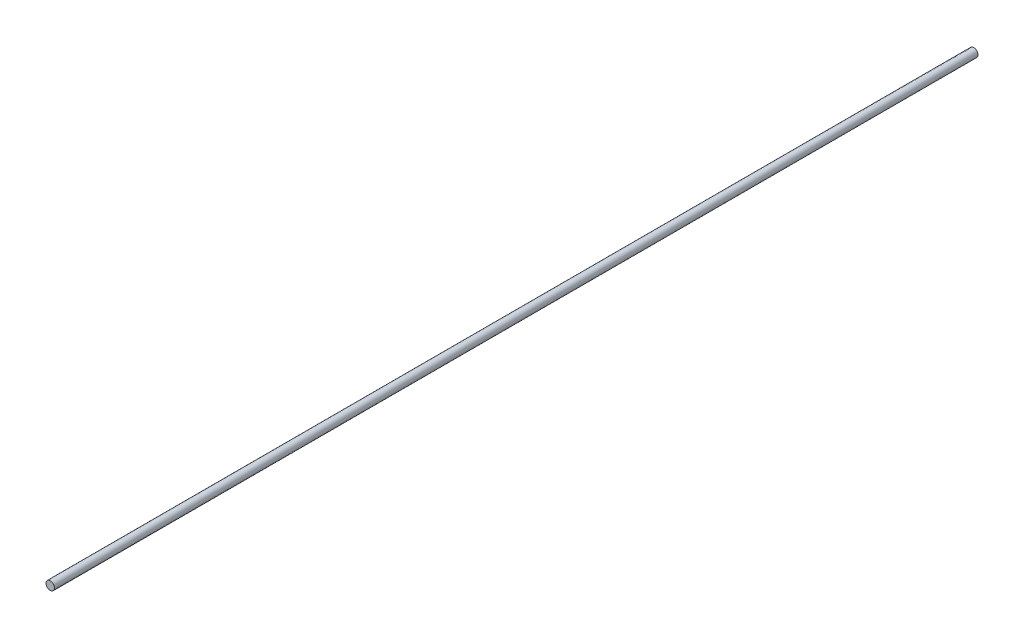
ISO-10303-21;
HEADER;
FILE_DESCRIPTION(('STEP AP214'),'2;1');
FILE_NAME('part.step','',(''),(''),'','','');
FILE_SCHEMA(('AUTOMOTIVE_DESIGN { 1 0 10303 214 1 1 1 1 }'));
ENDSEC;
DATA;
#1=APPLICATION_CONTEXT('core data for automotive mechanical design processes');
#2=APPLICATION_PROTOCOL_DEFINITION('international standard','automotive_design',2000,#1);
#3=PRODUCT_CONTEXT('',#1,'mechanical');
#4=PRODUCT('Part','Part','',(#3));
#5=PRODUCT_RELATED_PRODUCT_CATEGORY('part','',(#4));
#6=PRODUCT_DEFINITION_FORMATION('','',#4);
#7=PRODUCT_DEFINITION_CONTEXT('part definition',#1,'design');
#8=PRODUCT_DEFINITION('design','',#6,#7);
#9=PRODUCT_DEFINITION_SHAPE('','',#8);
#10=(LENGTH_UNIT() NAMED_UNIT(*) SI_UNIT(.MILLI.,.METRE.));
#11=(NAMED_UNIT(*) PLANE_ANGLE_UNIT() SI_UNIT($,.RADIAN.));
#12=(NAMED_UNIT(*) SI_UNIT($,.STERADIAN.) SOLID_ANGLE_UNIT());
#13=UNCERTAINTY_MEASURE_WITH_UNIT(LENGTH_MEASURE(1.E-05),#10,'distance_accuracy_value','');
#14=(GEOMETRIC_REPRESENTATION_CONTEXT(3) GLOBAL_UNCERTAINTY_ASSIGNED_CONTEXT((#13)) GLOBAL_UNIT_ASSIGNED_CONTEXT((#10,
#11,#12)) REPRESENTATION_CONTEXT('',''));
#15=CARTESIAN_POINT('',(0.,0.,0.));
#16=DIRECTION('',(0.,0.,1.));
#17=DIRECTION('',(1.,0.,0.));
#18=AXIS2_PLACEMENT_3D('',#15,#16,#17);
#19=CARTESIAN_POINT('',(0.,0.,875.));
#20=DIRECTION('',(0.,0.,-1.));
#21=DIRECTION('',(-1.,0.,0.));
#22=AXIS2_PLACEMENT_3D('',#19,#20,#21);
#23=CYLINDRICAL_SURFACE('',#22,4.);
#24=CARTESIAN_POINT('',(0.,0.,875.));
#25=DIRECTION('',(0.,0.,1.));
#26=DIRECTION('',(1.,0.,0.));
#27=AXIS2_PLACEMENT_3D('',#24,#25,#26);
#28=CIRCLE('',#27,4.);
#29=CARTESIAN_POINT('',(4.,0.,875.));
#30=VERTEX_POINT('',#29);
#31=EDGE_CURVE('E10',#30,#30,#28,.T.);
#32=ORIENTED_EDGE('',*,*,#31,.F.);
#33=EDGE_LOOP('',(#32));
#34=FACE_BOUND('',#33,.T.);
#35=CARTESIAN_POINT('',(0.,0.,0.));
#36=DIRECTION('',(0.,0.,1.));
#37=DIRECTION('',(1.,0.,0.));
#38=AXIS2_PLACEMENT_3D('',#35,#36,#37);
#39=CIRCLE('',#38,4.);
#40=CARTESIAN_POINT('',(4.,0.,0.));
#41=VERTEX_POINT('',#40);
#42=EDGE_CURVE('E40',#41,#41,#39,.T.);
#43=ORIENTED_EDGE('',*,*,#42,.T.);
#44=EDGE_LOOP('',(#43));
#45=FACE_BOUND('',#44,.T.);
#46=ADVANCED_FACE('F37',(#34,#45),#23,.T.);
#47=CARTESIAN_POINT('',(0.,0.,875.));
#48=DIRECTION('',(0.,0.,1.));
#49=DIRECTION('',(1.,0.,0.));
#50=AXIS2_PLACEMENT_3D('',#47,#48,#49);
#51=PLANE('',#50);
#52=ORIENTED_EDGE('',*,*,#31,.T.);
#53=EDGE_LOOP('',(#52));
#54=FACE_BOUND('',#53,.T.);
#55=ADVANCED_FACE('F54',(#54),#51,.T.);
#56=CARTESIAN_POINT('',(0.,0.,0.));
#57=DIRECTION('',(0.,0.,1.));
#58=DIRECTION('',(1.,0.,0.));
#59=AXIS2_PLACEMENT_3D('',#56,#57,#58);
#60=PLANE('',#59);
#61=ORIENTED_EDGE('',*,*,#42,.F.);
#62=EDGE_LOOP('',(#61));
#63=FACE_BOUND('',#62,.T.);
#64=ADVANCED_FACE('F52',(#63),#60,.F.);
#65=CLOSED_SHELL('',(#46,#55,#64));
#66=MANIFOLD_SOLID_BREP('B2',#65);
#67=ADVANCED_BREP_SHAPE_REPRESENTATION('',(#18,#66),#14);
#68=SHAPE_DEFINITION_REPRESENTATION(#9,#67);
ENDSEC;
END-ISO-10303-21;
